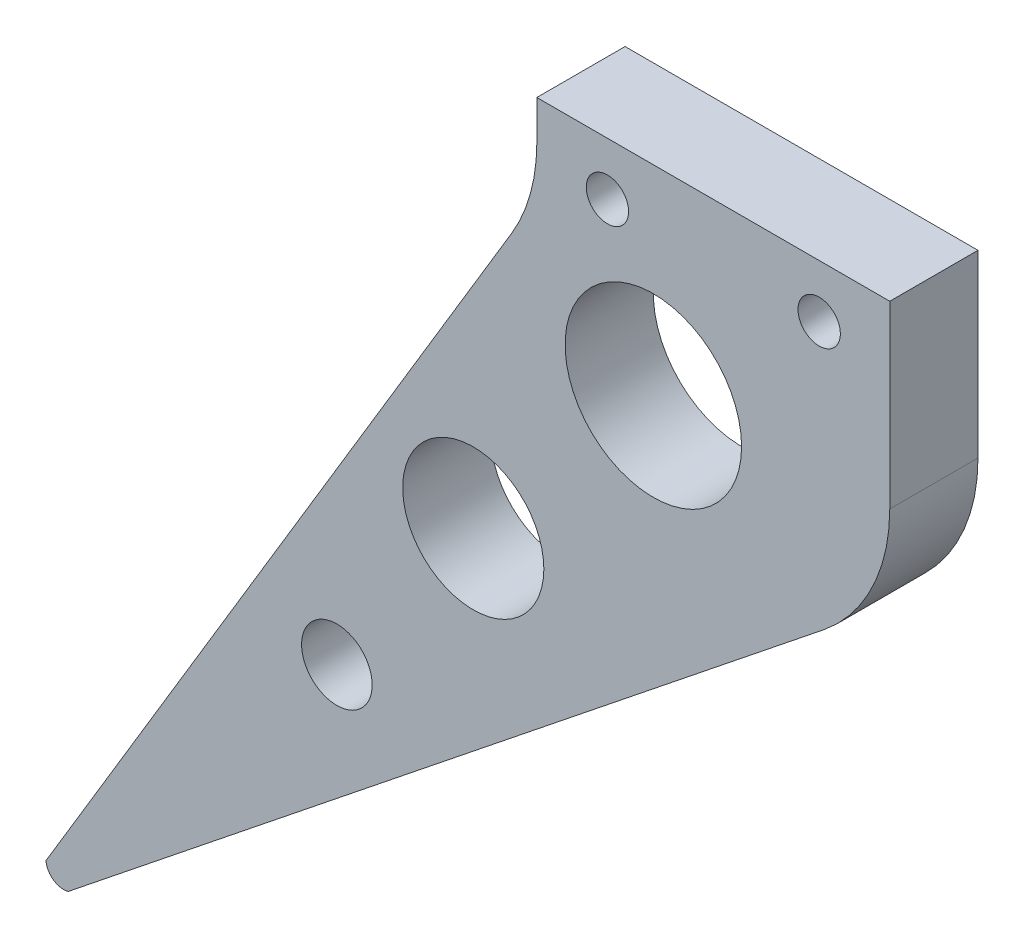
ISO-10303-21;
HEADER;
FILE_DESCRIPTION(('STEP AP214'),'2;1');
FILE_NAME('part.step','',(''),(''),'','','');
FILE_SCHEMA(('AUTOMOTIVE_DESIGN { 1 0 10303 214 1 1 1 1 }'));
ENDSEC;
DATA;
#1=APPLICATION_CONTEXT('core data for automotive mechanical design processes');
#2=APPLICATION_PROTOCOL_DEFINITION('international standard','automotive_design',2000,#1);
#3=PRODUCT_CONTEXT('',#1,'mechanical');
#4=PRODUCT('Part','Part','',(#3));
#5=PRODUCT_RELATED_PRODUCT_CATEGORY('part','',(#4));
#6=PRODUCT_DEFINITION_FORMATION('','',#4);
#7=PRODUCT_DEFINITION_CONTEXT('part definition',#1,'design');
#8=PRODUCT_DEFINITION('design','',#6,#7);
#9=PRODUCT_DEFINITION_SHAPE('','',#8);
#10=(LENGTH_UNIT() NAMED_UNIT(*) SI_UNIT(.MILLI.,.METRE.));
#11=(NAMED_UNIT(*) PLANE_ANGLE_UNIT() SI_UNIT($,.RADIAN.));
#12=(NAMED_UNIT(*) SI_UNIT($,.STERADIAN.) SOLID_ANGLE_UNIT());
#13=UNCERTAINTY_MEASURE_WITH_UNIT(LENGTH_MEASURE(1.E-05),#10,'distance_accuracy_value','');
#14=(GEOMETRIC_REPRESENTATION_CONTEXT(3) GLOBAL_UNCERTAINTY_ASSIGNED_CONTEXT((#13)) GLOBAL_UNIT_ASSIGNED_CONTEXT((#10,
#11,#12)) REPRESENTATION_CONTEXT('',''));
#15=CARTESIAN_POINT('',(0.,0.,0.));
#16=DIRECTION('',(0.,0.,1.));
#17=DIRECTION('',(1.,0.,0.));
#18=AXIS2_PLACEMENT_3D('',#15,#16,#17);
#19=CARTESIAN_POINT('',(0.,0.,0.));
#20=DIRECTION('',(0.,0.,1.));
#21=DIRECTION('',(1.,0.,0.));
#22=AXIS2_PLACEMENT_3D('',#19,#20,#21);
#23=PLANE('',#22);
#24=CARTESIAN_POINT('',(46.,52.,0.));
#25=DIRECTION('',(0.,0.,1.));
#26=DIRECTION('',(1.,0.,0.));
#27=AXIS2_PLACEMENT_3D('',#24,#25,#26);
#28=CIRCLE('',#27,1.19999999999999);
#29=CARTESIAN_POINT('',(47.2,52.,0.));
#30=VERTEX_POINT('',#29);
#31=EDGE_CURVE('E205',#30,#30,#28,.T.);
#32=ORIENTED_EDGE('',*,*,#31,.T.);
#33=EDGE_LOOP('',(#32));
#34=FACE_BOUND('',#33,.T.);
#35=CARTESIAN_POINT('',(34.,52.,0.));
#36=DIRECTION('',(0.,0.,1.));
#37=DIRECTION('',(1.,0.,0.));
#38=AXIS2_PLACEMENT_3D('',#35,#36,#37);
#39=CIRCLE('',#38,1.19999999999999);
#40=CARTESIAN_POINT('',(35.2,52.,0.));
#41=VERTEX_POINT('',#40);
#42=EDGE_CURVE('E115',#41,#41,#39,.T.);
#43=ORIENTED_EDGE('',*,*,#42,.T.);
#44=EDGE_LOOP('',(#43));
#45=FACE_BOUND('',#44,.T.);
#46=CARTESIAN_POINT('',(18.6683769173565,21.4968040421027,0.));
#47=DIRECTION('',(0.,0.,1.));
#48=DIRECTION('',(1.,0.,0.));
#49=AXIS2_PLACEMENT_3D('',#46,#47,#48);
#50=CIRCLE('',#49,2.);
#51=CARTESIAN_POINT('',(20.6683769173565,21.4968040421027,0.));
#52=VERTEX_POINT('',#51);
#53=EDGE_CURVE('E135',#52,#52,#50,.T.);
#54=ORIENTED_EDGE('',*,*,#53,.T.);
#55=EDGE_LOOP('',(#54));
#56=FACE_BOUND('',#55,.T.);
#57=CARTESIAN_POINT('',(26.3974861009215,32.0543403504138,0.));
#58=DIRECTION('',(0.,0.,1.));
#59=DIRECTION('',(1.,0.,0.));
#60=AXIS2_PLACEMENT_3D('',#57,#58,#59);
#61=CIRCLE('',#60,4.);
#62=CARTESIAN_POINT('',(30.3974861009215,32.0543403504138,0.));
#63=VERTEX_POINT('',#62);
#64=EDGE_CURVE('E139',#63,#63,#61,.T.);
#65=ORIENTED_EDGE('',*,*,#64,.T.);
#66=EDGE_LOOP('',(#65));
#67=FACE_BOUND('',#66,.T.);
#68=CARTESIAN_POINT('',(36.6023616529889,43.6734294648544,0.));
#69=DIRECTION('',(0.,0.,1.));
#70=DIRECTION('',(1.,0.,0.));
#71=AXIS2_PLACEMENT_3D('',#68,#69,#70);
#72=CIRCLE('',#71,5.);
#73=CARTESIAN_POINT('',(41.6023616529889,43.6734294648544,0.));
#74=VERTEX_POINT('',#73);
#75=EDGE_CURVE('E145',#74,#74,#72,.T.);
#76=ORIENTED_EDGE('',*,*,#75,.T.);
#77=EDGE_LOOP('',(#76));
#78=FACE_BOUND('',#77,.T.);
#79=DIRECTION('',(0.,1.,0.));
#80=VECTOR('',#79,1.);
#81=CARTESIAN_POINT('',(50.,50.,0.));
#82=LINE('',#81,#80);
#83=CARTESIAN_POINT('',(50.,44.8062484748657,0.));
#84=VERTEX_POINT('',#83);
#85=CARTESIAN_POINT('',(50.,55.,0.));
#86=VERTEX_POINT('',#85);
#87=EDGE_CURVE('E163',#84,#86,#82,.T.);
#88=ORIENTED_EDGE('',*,*,#87,.F.);
#89=CARTESIAN_POINT('',(40.,44.8062484748657,0.));
#90=DIRECTION('',(0.,0.,1.));
#91=DIRECTION('',(1.,0.,0.));
#92=AXIS2_PLACEMENT_3D('',#89,#90,#91);
#93=CIRCLE('',#92,10.);
#94=CARTESIAN_POINT('',(46.2469504755442,36.9975603804354,0.));
#95=VERTEX_POINT('',#94);
#96=EDGE_CURVE('E168',#84,#95,#93,.F.);
#97=ORIENTED_EDGE('',*,*,#96,.T.);
#98=DIRECTION('',(0.78086880944303,0.624695047554424,0.));
#99=VECTOR('',#98,1.);
#100=CARTESIAN_POINT('',(50.,40.,0.));
#101=LINE('',#100,#99);
#102=CARTESIAN_POINT('',(3.44617862593635,2.75694290074908,0.));
#103=VERTEX_POINT('',#102);
#104=EDGE_CURVE('E151',#103,#95,#101,.T.);
#105=ORIENTED_EDGE('',*,*,#104,.F.);
#106=CARTESIAN_POINT('',(3.18255805265129,3.72156935349691,0.));
#107=DIRECTION('',(0.,0.,1.));
#108=DIRECTION('',(1.,0.,0.));
#109=AXIS2_PLACEMENT_3D('',#106,#107,#108);
#110=CIRCLE('',#109,1.);
#111=CARTESIAN_POINT('',(2.18566690946479,3.6427781824413,0.));
#112=VERTEX_POINT('',#111);
#113=EDGE_CURVE('E118',#103,#112,#110,.F.);
#114=ORIENTED_EDGE('',*,*,#113,.T.);
#115=DIRECTION('',(-0.514495755427526,-0.857492925712544,0.));
#116=VECTOR('',#115,1.);
#117=CARTESIAN_POINT('',(0.,0.,0.));
#118=LINE('',#117,#116);
#119=CARTESIAN_POINT('',(28.5749292571255,47.6248820952091,0.));
#120=VERTEX_POINT('',#119);
#121=EDGE_CURVE('E156',#120,#112,#118,.T.);
#122=ORIENTED_EDGE('',*,*,#121,.F.);
#123=CARTESIAN_POINT('',(20.,52.7698396494844,0.));
#124=DIRECTION('',(0.,0.,1.));
#125=DIRECTION('',(1.,0.,0.));
#126=AXIS2_PLACEMENT_3D('',#123,#124,#125);
#127=CIRCLE('',#126,10.);
#128=CARTESIAN_POINT('',(30.,52.7698396494844,0.));
#129=VERTEX_POINT('',#128);
#130=EDGE_CURVE('E40',#120,#129,#127,.T.);
#131=ORIENTED_EDGE('',*,*,#130,.T.);
#132=DIRECTION('',(0.,-1.,0.));
#133=VECTOR('',#132,1.);
#134=CARTESIAN_POINT('',(30.,55.,0.));
#135=LINE('',#134,#133);
#136=CARTESIAN_POINT('',(30.,55.,0.));
#137=VERTEX_POINT('',#136);
#138=EDGE_CURVE('E119',#137,#129,#135,.T.);
#139=ORIENTED_EDGE('',*,*,#138,.F.);
#140=DIRECTION('',(-1.,0.,0.));
#141=VECTOR('',#140,1.);
#142=CARTESIAN_POINT('',(30.,55.,0.));
#143=LINE('',#142,#141);
#144=EDGE_CURVE('E114',#86,#137,#143,.T.);
#145=ORIENTED_EDGE('',*,*,#144,.F.);
#146=EDGE_LOOP('',(#88,#97,#105,#114,#122,#131,#139,#145));
#147=FACE_BOUND('',#146,.T.);
#148=ADVANCED_FACE('F32',(#34,#45,#56,#67,#78,#147),#23,.F.);
#149=CARTESIAN_POINT('',(0.,0.,5.));
#150=DIRECTION('',(0.857492925712544,-0.514495755427526,0.));
#151=DIRECTION('',(0.514495755427526,0.857492925712544,0.));
#152=AXIS2_PLACEMENT_3D('',#149,#150,#151);
#153=PLANE('',#152);
#154=DIRECTION('',(-0.514495755427526,-0.857492925712544,0.));
#155=VECTOR('',#154,1.);
#156=CARTESIAN_POINT('',(0.,0.,5.));
#157=LINE('',#156,#155);
#158=CARTESIAN_POINT('',(28.5749292571255,47.6248820952091,5.));
#159=VERTEX_POINT('',#158);
#160=CARTESIAN_POINT('',(2.18566690946479,3.64277818244131,5.));
#161=VERTEX_POINT('',#160);
#162=EDGE_CURVE('E158',#159,#161,#157,.T.);
#163=ORIENTED_EDGE('',*,*,#162,.F.);
#164=DIRECTION('',(0.,0.,-1.));
#165=VECTOR('',#164,1.);
#166=CARTESIAN_POINT('',(28.5749292571254,47.6248820952091,0.));
#167=LINE('',#166,#165);
#168=EDGE_CURVE('E174',#159,#120,#167,.T.);
#169=ORIENTED_EDGE('',*,*,#168,.T.);
#170=ORIENTED_EDGE('',*,*,#121,.T.);
#171=DIRECTION('',(0.,0.,1.));
#172=VECTOR('',#171,1.);
#173=CARTESIAN_POINT('',(2.18566690946479,3.6427781824413,-94.8590429922364));
#174=LINE('',#173,#172);
#175=EDGE_CURVE('E128',#112,#161,#174,.T.);
#176=ORIENTED_EDGE('',*,*,#175,.T.);
#177=EDGE_LOOP('',(#163,#169,#170,#176));
#178=FACE_BOUND('',#177,.T.);
#179=ADVANCED_FACE('F180',(#178),#153,.F.);
#180=CARTESIAN_POINT('',(0.,0.,5.));
#181=DIRECTION('',(0.,0.,1.));
#182=DIRECTION('',(1.,0.,0.));
#183=AXIS2_PLACEMENT_3D('',#180,#181,#182);
#184=PLANE('',#183);
#185=CARTESIAN_POINT('',(46.,52.,5.));
#186=DIRECTION('',(0.,0.,1.));
#187=DIRECTION('',(1.,0.,0.));
#188=AXIS2_PLACEMENT_3D('',#185,#186,#187);
#189=CIRCLE('',#188,1.19999999999999);
#190=CARTESIAN_POINT('',(47.2,52.,5.));
#191=VERTEX_POINT('',#190);
#192=EDGE_CURVE('E208',#191,#191,#189,.T.);
#193=ORIENTED_EDGE('',*,*,#192,.F.);
#194=EDGE_LOOP('',(#193));
#195=FACE_BOUND('',#194,.T.);
#196=CARTESIAN_POINT('',(34.,52.,5.));
#197=DIRECTION('',(0.,0.,1.));
#198=DIRECTION('',(1.,0.,0.));
#199=AXIS2_PLACEMENT_3D('',#196,#197,#198);
#200=CIRCLE('',#199,1.19999999999999);
#201=CARTESIAN_POINT('',(35.2,52.,5.));
#202=VERTEX_POINT('',#201);
#203=EDGE_CURVE('E202',#202,#202,#200,.T.);
#204=ORIENTED_EDGE('',*,*,#203,.F.);
#205=EDGE_LOOP('',(#204));
#206=FACE_BOUND('',#205,.T.);
#207=DIRECTION('',(0.78086880944303,0.624695047554424,0.));
#208=VECTOR('',#207,1.);
#209=CARTESIAN_POINT('',(50.,40.,5.));
#210=LINE('',#209,#208);
#211=CARTESIAN_POINT('',(3.44617862593635,2.75694290074908,5.));
#212=VERTEX_POINT('',#211);
#213=CARTESIAN_POINT('',(46.2469504755442,36.9975603804354,5.));
#214=VERTEX_POINT('',#213);
#215=EDGE_CURVE('E154',#212,#214,#210,.T.);
#216=ORIENTED_EDGE('',*,*,#215,.T.);
#217=CARTESIAN_POINT('',(40.,44.8062484748657,5.));
#218=DIRECTION('',(0.,0.,1.));
#219=DIRECTION('',(1.,0.,0.));
#220=AXIS2_PLACEMENT_3D('',#217,#218,#219);
#221=CIRCLE('',#220,10.);
#222=CARTESIAN_POINT('',(50.,44.8062484748657,5.));
#223=VERTEX_POINT('',#222);
#224=EDGE_CURVE('E172',#214,#223,#221,.T.);
#225=ORIENTED_EDGE('',*,*,#224,.T.);
#226=DIRECTION('',(0.,1.,0.));
#227=VECTOR('',#226,1.);
#228=CARTESIAN_POINT('',(50.,50.,5.));
#229=LINE('',#228,#227);
#230=CARTESIAN_POINT('',(50.,55.,5.));
#231=VERTEX_POINT('',#230);
#232=EDGE_CURVE('E104',#223,#231,#229,.T.);
#233=ORIENTED_EDGE('',*,*,#232,.T.);
#234=DIRECTION('',(1.,0.,0.));
#235=VECTOR('',#234,1.);
#236=CARTESIAN_POINT('',(30.,55.,5.));
#237=LINE('',#236,#235);
#238=CARTESIAN_POINT('',(30.,55.,5.));
#239=VERTEX_POINT('',#238);
#240=EDGE_CURVE('E96',#239,#231,#237,.T.);
#241=ORIENTED_EDGE('',*,*,#240,.F.);
#242=DIRECTION('',(0.,-1.,0.));
#243=VECTOR('',#242,1.);
#244=CARTESIAN_POINT('',(30.,55.,5.));
#245=LINE('',#244,#243);
#246=CARTESIAN_POINT('',(30.,52.7698396494844,5.));
#247=VERTEX_POINT('',#246);
#248=EDGE_CURVE('E101',#239,#247,#245,.T.);
#249=ORIENTED_EDGE('',*,*,#248,.T.);
#250=CARTESIAN_POINT('',(20.,52.7698396494844,5.));
#251=DIRECTION('',(0.,0.,1.));
#252=DIRECTION('',(1.,0.,0.));
#253=AXIS2_PLACEMENT_3D('',#250,#251,#252);
#254=CIRCLE('',#253,10.);
#255=EDGE_CURVE('E11',#247,#159,#254,.F.);
#256=ORIENTED_EDGE('',*,*,#255,.T.);
#257=ORIENTED_EDGE('',*,*,#162,.T.);
#258=CARTESIAN_POINT('',(3.18255805265129,3.72156935349691,5.));
#259=DIRECTION('',(0.,0.,1.));
#260=DIRECTION('',(1.,0.,0.));
#261=AXIS2_PLACEMENT_3D('',#258,#259,#260);
#262=CIRCLE('',#261,1.);
#263=EDGE_CURVE('E122',#212,#161,#262,.F.);
#264=ORIENTED_EDGE('',*,*,#263,.F.);
#265=EDGE_LOOP('',(#216,#225,#233,#241,#249,#256,#257,#264));
#266=FACE_BOUND('',#265,.T.);
#267=CARTESIAN_POINT('',(26.3974861009215,32.0543403504138,5.));
#268=DIRECTION('',(0.,0.,1.));
#269=DIRECTION('',(1.,0.,0.));
#270=AXIS2_PLACEMENT_3D('',#267,#268,#269);
#271=CIRCLE('',#270,4.);
#272=CARTESIAN_POINT('',(30.3974861009215,32.0543403504138,5.));
#273=VERTEX_POINT('',#272);
#274=EDGE_CURVE('E142',#273,#273,#271,.T.);
#275=ORIENTED_EDGE('',*,*,#274,.F.);
#276=EDGE_LOOP('',(#275));
#277=FACE_BOUND('',#276,.T.);
#278=CARTESIAN_POINT('',(36.6023616529889,43.6734294648544,5.));
#279=DIRECTION('',(0.,0.,1.));
#280=DIRECTION('',(1.,0.,0.));
#281=AXIS2_PLACEMENT_3D('',#278,#279,#280);
#282=CIRCLE('',#281,5.);
#283=CARTESIAN_POINT('',(41.6023616529889,43.6734294648544,5.));
#284=VERTEX_POINT('',#283);
#285=EDGE_CURVE('E148',#284,#284,#282,.T.);
#286=ORIENTED_EDGE('',*,*,#285,.F.);
#287=EDGE_LOOP('',(#286));
#288=FACE_BOUND('',#287,.T.);
#289=CARTESIAN_POINT('',(18.6683769173565,21.4968040421027,5.));
#290=DIRECTION('',(0.,0.,1.));
#291=DIRECTION('',(1.,0.,0.));
#292=AXIS2_PLACEMENT_3D('',#289,#290,#291);
#293=CIRCLE('',#292,2.);
#294=CARTESIAN_POINT('',(20.6683769173565,21.4968040421027,5.));
#295=VERTEX_POINT('',#294);
#296=EDGE_CURVE('E136',#295,#295,#293,.T.);
#297=ORIENTED_EDGE('',*,*,#296,.F.);
#298=EDGE_LOOP('',(#297));
#299=FACE_BOUND('',#298,.T.);
#300=ADVANCED_FACE('F99',(#195,#206,#266,#277,#288,#299),#184,.T.);
#301=CARTESIAN_POINT('',(50.,40.,5.));
#302=DIRECTION('',(-0.624695047554424,0.78086880944303,0.));
#303=DIRECTION('',(-0.78086880944303,-0.624695047554424,0.));
#304=AXIS2_PLACEMENT_3D('',#301,#302,#303);
#305=PLANE('',#304);
#306=ORIENTED_EDGE('',*,*,#104,.T.);
#307=DIRECTION('',(0.,0.,-1.));
#308=VECTOR('',#307,1.);
#309=CARTESIAN_POINT('',(46.2469504755442,36.9975603804354,5.));
#310=LINE('',#309,#308);
#311=EDGE_CURVE('E170',#95,#214,#310,.F.);
#312=ORIENTED_EDGE('',*,*,#311,.T.);
#313=ORIENTED_EDGE('',*,*,#215,.F.);
#314=DIRECTION('',(0.,0.,1.));
#315=VECTOR('',#314,1.);
#316=CARTESIAN_POINT('',(3.44617862593634,2.75694290074908,-94.8590429922364));
#317=LINE('',#316,#315);
#318=EDGE_CURVE('E132',#103,#212,#317,.T.);
#319=ORIENTED_EDGE('',*,*,#318,.F.);
#320=EDGE_LOOP('',(#306,#312,#313,#319));
#321=FACE_BOUND('',#320,.T.);
#322=ADVANCED_FACE('F191',(#321),#305,.F.);
#323=CARTESIAN_POINT('',(50.,50.,5.));
#324=DIRECTION('',(-1.,0.,0.));
#325=DIRECTION('',(0.,0.,1.));
#326=AXIS2_PLACEMENT_3D('',#323,#324,#325);
#327=PLANE('',#326);
#328=ORIENTED_EDGE('',*,*,#232,.F.);
#329=DIRECTION('',(0.,0.,-1.));
#330=VECTOR('',#329,1.);
#331=CARTESIAN_POINT('',(50.,44.8062484748657,5.));
#332=LINE('',#331,#330);
#333=EDGE_CURVE('E160',#223,#84,#332,.T.);
#334=ORIENTED_EDGE('',*,*,#333,.T.);
#335=ORIENTED_EDGE('',*,*,#87,.T.);
#336=DIRECTION('',(0.,0.,-1.));
#337=VECTOR('',#336,1.);
#338=CARTESIAN_POINT('',(50.,55.,0.));
#339=LINE('',#338,#337);
#340=EDGE_CURVE('E108',#231,#86,#339,.T.);
#341=ORIENTED_EDGE('',*,*,#340,.F.);
#342=EDGE_LOOP('',(#328,#334,#335,#341));
#343=FACE_BOUND('',#342,.T.);
#344=ADVANCED_FACE('F197',(#343),#327,.F.);
#345=CARTESIAN_POINT('',(36.6023616529889,43.6734294648544,5.));
#346=DIRECTION('',(0.,0.,-1.));
#347=DIRECTION('',(-1.,0.,0.));
#348=AXIS2_PLACEMENT_3D('',#345,#346,#347);
#349=CYLINDRICAL_SURFACE('',#348,5.);
#350=ORIENTED_EDGE('',*,*,#285,.T.);
#351=EDGE_LOOP('',(#350));
#352=FACE_BOUND('',#351,.T.);
#353=ORIENTED_EDGE('',*,*,#75,.F.);
#354=EDGE_LOOP('',(#353));
#355=FACE_BOUND('',#354,.T.);
#356=ADVANCED_FACE('F243',(#352,#355),#349,.F.);
#357=CARTESIAN_POINT('',(26.3974861009215,32.0543403504138,5.));
#358=DIRECTION('',(0.,0.,-1.));
#359=DIRECTION('',(-1.,0.,0.));
#360=AXIS2_PLACEMENT_3D('',#357,#358,#359);
#361=CYLINDRICAL_SURFACE('',#360,4.);
#362=ORIENTED_EDGE('',*,*,#274,.T.);
#363=EDGE_LOOP('',(#362));
#364=FACE_BOUND('',#363,.T.);
#365=ORIENTED_EDGE('',*,*,#64,.F.);
#366=EDGE_LOOP('',(#365));
#367=FACE_BOUND('',#366,.T.);
#368=ADVANCED_FACE('F256',(#364,#367),#361,.F.);
#369=CARTESIAN_POINT('',(18.6683769173565,21.4968040421027,5.));
#370=DIRECTION('',(0.,0.,-1.));
#371=DIRECTION('',(-1.,0.,0.));
#372=AXIS2_PLACEMENT_3D('',#369,#370,#371);
#373=CYLINDRICAL_SURFACE('',#372,2.);
#374=ORIENTED_EDGE('',*,*,#296,.T.);
#375=EDGE_LOOP('',(#374));
#376=FACE_BOUND('',#375,.T.);
#377=ORIENTED_EDGE('',*,*,#53,.F.);
#378=EDGE_LOOP('',(#377));
#379=FACE_BOUND('',#378,.T.);
#380=ADVANCED_FACE('F251',(#376,#379),#373,.F.);
#381=CARTESIAN_POINT('',(3.18255805265129,3.72156935349691,-94.8590429922364));
#382=DIRECTION('',(0.,0.,1.));
#383=DIRECTION('',(1.,0.,0.));
#384=AXIS2_PLACEMENT_3D('',#381,#382,#383);
#385=CYLINDRICAL_SURFACE('',#384,1.);
#386=ORIENTED_EDGE('',*,*,#113,.F.);
#387=ORIENTED_EDGE('',*,*,#318,.T.);
#388=ORIENTED_EDGE('',*,*,#263,.T.);
#389=ORIENTED_EDGE('',*,*,#175,.F.);
#390=EDGE_LOOP('',(#386,#387,#388,#389));
#391=FACE_BOUND('',#390,.T.);
#392=ADVANCED_FACE('F187',(#391),#385,.T.);
#393=CARTESIAN_POINT('',(40.,44.8062484748657,5.));
#394=DIRECTION('',(0.,0.,-1.));
#395=DIRECTION('',(-1.,0.,0.));
#396=AXIS2_PLACEMENT_3D('',#393,#394,#395);
#397=CYLINDRICAL_SURFACE('',#396,10.);
#398=ORIENTED_EDGE('',*,*,#224,.F.);
#399=ORIENTED_EDGE('',*,*,#311,.F.);
#400=ORIENTED_EDGE('',*,*,#96,.F.);
#401=ORIENTED_EDGE('',*,*,#333,.F.);
#402=EDGE_LOOP('',(#398,#399,#400,#401));
#403=FACE_BOUND('',#402,.T.);
#404=ADVANCED_FACE('F194',(#403),#397,.T.);
#405=CARTESIAN_POINT('',(30.,55.,0.));
#406=DIRECTION('',(1.,0.,0.));
#407=DIRECTION('',(0.,0.,-1.));
#408=AXIS2_PLACEMENT_3D('',#405,#406,#407);
#409=PLANE('',#408);
#410=ORIENTED_EDGE('',*,*,#138,.T.);
#411=DIRECTION('',(0.,0.,-1.));
#412=VECTOR('',#411,1.);
#413=CARTESIAN_POINT('',(30.,52.7698396494844,5.));
#414=LINE('',#413,#412);
#415=EDGE_CURVE('E53',#129,#247,#414,.F.);
#416=ORIENTED_EDGE('',*,*,#415,.T.);
#417=ORIENTED_EDGE('',*,*,#248,.F.);
#418=DIRECTION('',(0.,0.,1.));
#419=VECTOR('',#418,1.);
#420=CARTESIAN_POINT('',(30.,55.,0.));
#421=LINE('',#420,#419);
#422=EDGE_CURVE('E109',#137,#239,#421,.T.);
#423=ORIENTED_EDGE('',*,*,#422,.F.);
#424=EDGE_LOOP('',(#410,#416,#417,#423));
#425=FACE_BOUND('',#424,.T.);
#426=ADVANCED_FACE('F117',(#425),#409,.F.);
#427=CARTESIAN_POINT('',(0.,55.,0.));
#428=DIRECTION('',(0.,1.,0.));
#429=DIRECTION('',(0.,0.,1.));
#430=AXIS2_PLACEMENT_3D('',#427,#428,#429);
#431=PLANE('',#430);
#432=ORIENTED_EDGE('',*,*,#422,.T.);
#433=ORIENTED_EDGE('',*,*,#240,.T.);
#434=ORIENTED_EDGE('',*,*,#340,.T.);
#435=ORIENTED_EDGE('',*,*,#144,.T.);
#436=EDGE_LOOP('',(#432,#433,#434,#435));
#437=FACE_BOUND('',#436,.T.);
#438=ADVANCED_FACE('F112',(#437),#431,.T.);
#439=CARTESIAN_POINT('',(34.,52.,5.));
#440=DIRECTION('',(0.,0.,1.));
#441=DIRECTION('',(1.,0.,0.));
#442=AXIS2_PLACEMENT_3D('',#439,#440,#441);
#443=CYLINDRICAL_SURFACE('',#442,1.19999999999999);
#444=ORIENTED_EDGE('',*,*,#42,.F.);
#445=EDGE_LOOP('',(#444));
#446=FACE_BOUND('',#445,.T.);
#447=ORIENTED_EDGE('',*,*,#203,.T.);
#448=EDGE_LOOP('',(#447));
#449=FACE_BOUND('',#448,.T.);
#450=ADVANCED_FACE('F219',(#446,#449),#443,.F.);
#451=CARTESIAN_POINT('',(46.,52.,5.));
#452=DIRECTION('',(0.,0.,1.));
#453=DIRECTION('',(1.,0.,0.));
#454=AXIS2_PLACEMENT_3D('',#451,#452,#453);
#455=CYLINDRICAL_SURFACE('',#454,1.19999999999999);
#456=ORIENTED_EDGE('',*,*,#31,.F.);
#457=EDGE_LOOP('',(#456));
#458=FACE_BOUND('',#457,.T.);
#459=ORIENTED_EDGE('',*,*,#192,.T.);
#460=EDGE_LOOP('',(#459));
#461=FACE_BOUND('',#460,.T.);
#462=ADVANCED_FACE('F212',(#458,#461),#455,.F.);
#463=CARTESIAN_POINT('',(20.,52.7698396494844,5.));
#464=DIRECTION('',(0.,0.,1.));
#465=DIRECTION('',(1.,0.,0.));
#466=AXIS2_PLACEMENT_3D('',#463,#464,#465);
#467=CYLINDRICAL_SURFACE('',#466,10.);
#468=ORIENTED_EDGE('',*,*,#255,.F.);
#469=ORIENTED_EDGE('',*,*,#415,.F.);
#470=ORIENTED_EDGE('',*,*,#130,.F.);
#471=ORIENTED_EDGE('',*,*,#168,.F.);
#472=EDGE_LOOP('',(#468,#469,#470,#471));
#473=FACE_BOUND('',#472,.T.);
#474=ADVANCED_FACE('F34',(#473),#467,.F.);
#475=CLOSED_SHELL('',(#148,#179,#300,#322,#344,#356,#368,#380,#392,#404,#426,#438,#450,#462,#474));
#476=MANIFOLD_SOLID_BREP('B2',#475);
#477=ADVANCED_BREP_SHAPE_REPRESENTATION('',(#18,#476),#14);
#478=SHAPE_DEFINITION_REPRESENTATION(#9,#477);
ENDSEC;
END-ISO-10303-21;
